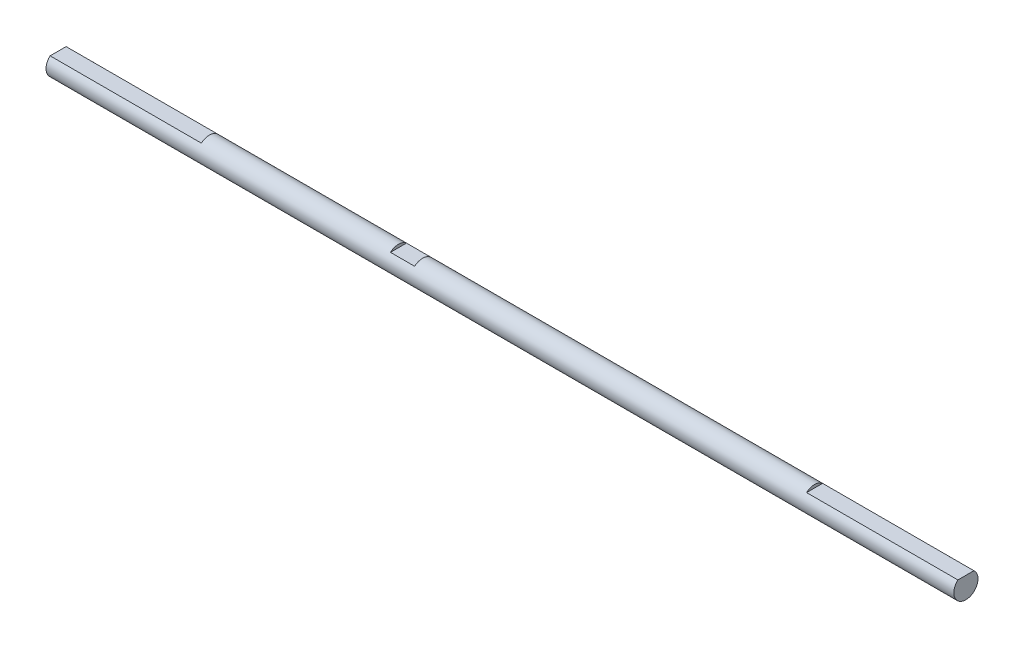
ISO-10303-21;
HEADER;
FILE_DESCRIPTION(('STEP AP214'),'2;1');
FILE_NAME('part.step','',(''),(''),'','','');
FILE_SCHEMA(('AUTOMOTIVE_DESIGN { 1 0 10303 214 1 1 1 1 }'));
ENDSEC;
DATA;
#1=APPLICATION_CONTEXT('core data for automotive mechanical design processes');
#2=APPLICATION_PROTOCOL_DEFINITION('international standard','automotive_design',2000,#1);
#3=PRODUCT_CONTEXT('',#1,'mechanical');
#4=PRODUCT('Part','Part','',(#3));
#5=PRODUCT_RELATED_PRODUCT_CATEGORY('part','',(#4));
#6=PRODUCT_DEFINITION_FORMATION('','',#4);
#7=PRODUCT_DEFINITION_CONTEXT('part definition',#1,'design');
#8=PRODUCT_DEFINITION('design','',#6,#7);
#9=PRODUCT_DEFINITION_SHAPE('','',#8);
#10=(LENGTH_UNIT() NAMED_UNIT(*) SI_UNIT(.MILLI.,.METRE.));
#11=(NAMED_UNIT(*) PLANE_ANGLE_UNIT() SI_UNIT($,.RADIAN.));
#12=(NAMED_UNIT(*) SI_UNIT($,.STERADIAN.) SOLID_ANGLE_UNIT());
#13=UNCERTAINTY_MEASURE_WITH_UNIT(LENGTH_MEASURE(1.E-05),#10,'distance_accuracy_value','');
#14=(GEOMETRIC_REPRESENTATION_CONTEXT(3) GLOBAL_UNCERTAINTY_ASSIGNED_CONTEXT((#13)) GLOBAL_UNIT_ASSIGNED_CONTEXT((#10,
#11,#12)) REPRESENTATION_CONTEXT('',''));
#15=CARTESIAN_POINT('',(0.,0.,0.));
#16=DIRECTION('',(0.,0.,1.));
#17=DIRECTION('',(1.,0.,0.));
#18=AXIS2_PLACEMENT_3D('',#15,#16,#17);
#19=CARTESIAN_POINT('',(75.,1.5,1.3228756555323));
#20=DIRECTION('',(0.,-1.,0.));
#21=DIRECTION('',(0.,0.,-1.));
#22=AXIS2_PLACEMENT_3D('',#19,#20,#21);
#23=PLANE('',#22);
#24=DIRECTION('',(0.,0.,1.));
#25=VECTOR('',#24,1.);
#26=CARTESIAN_POINT('',(-50.,1.5,1.3228756555323));
#27=LINE('',#26,#25);
#28=CARTESIAN_POINT('',(-50.,1.5,-1.3228756555323));
#29=VERTEX_POINT('',#28);
#30=CARTESIAN_POINT('',(-50.,1.5,1.3228756555323));
#31=VERTEX_POINT('',#30);
#32=EDGE_CURVE('E69',#29,#31,#27,.T.);
#33=ORIENTED_EDGE('',*,*,#32,.F.);
#34=DIRECTION('',(-1.,0.,0.));
#35=VECTOR('',#34,1.);
#36=CARTESIAN_POINT('',(75.,1.5,-1.3228756555323));
#37=LINE('',#36,#35);
#38=CARTESIAN_POINT('',(-75.,1.5,-1.3228756555323));
#39=VERTEX_POINT('',#38);
#40=EDGE_CURVE('E144',#29,#39,#37,.T.);
#41=ORIENTED_EDGE('',*,*,#40,.T.);
#42=DIRECTION('',(0.,0.,1.));
#43=VECTOR('',#42,1.);
#44=CARTESIAN_POINT('',(-75.,1.5,1.3228756555323));
#45=LINE('',#44,#43);
#46=CARTESIAN_POINT('',(-75.,1.5,1.3228756555323));
#47=VERTEX_POINT('',#46);
#48=EDGE_CURVE('E130',#39,#47,#45,.T.);
#49=ORIENTED_EDGE('',*,*,#48,.T.);
#50=DIRECTION('',(-1.,0.,0.));
#51=VECTOR('',#50,1.);
#52=CARTESIAN_POINT('',(75.,1.5,1.3228756555323));
#53=LINE('',#52,#51);
#54=EDGE_CURVE('E133',#31,#47,#53,.T.);
#55=ORIENTED_EDGE('',*,*,#54,.F.);
#56=EDGE_LOOP('',(#33,#41,#49,#55));
#57=FACE_BOUND('',#56,.T.);
#58=ADVANCED_FACE('F45',(#57),#23,.F.);
#59=CARTESIAN_POINT('',(75.,0.,0.));
#60=DIRECTION('',(-1.,0.,0.));
#61=DIRECTION('',(0.,0.,1.));
#62=AXIS2_PLACEMENT_3D('',#59,#60,#61);
#63=CYLINDRICAL_SURFACE('',#62,2.);
#64=CARTESIAN_POINT('',(-14.76,0.,0.));
#65=DIRECTION('',(1.,0.,0.));
#66=DIRECTION('',(0.,0.,-1.));
#67=AXIS2_PLACEMENT_3D('',#64,#65,#66);
#68=CIRCLE('',#67,2.);
#69=CARTESIAN_POINT('',(-14.76,1.5,-1.3228756555323));
#70=VERTEX_POINT('',#69);
#71=CARTESIAN_POINT('',(-14.76,1.5,1.3228756555323));
#72=VERTEX_POINT('',#71);
#73=EDGE_CURVE('E99',#70,#72,#68,.T.);
#74=ORIENTED_EDGE('',*,*,#73,.T.);
#75=DIRECTION('',(-1.,0.,0.));
#76=VECTOR('',#75,1.);
#77=CARTESIAN_POINT('',(75.,1.5,1.3228756555323));
#78=LINE('',#77,#76);
#79=CARTESIAN_POINT('',(-18.76,1.5,1.3228756555323));
#80=VERTEX_POINT('',#79);
#81=EDGE_CURVE('E11',#72,#80,#78,.T.);
#82=ORIENTED_EDGE('',*,*,#81,.T.);
#83=CARTESIAN_POINT('',(-18.76,0.,0.));
#84=DIRECTION('',(-1.,0.,0.));
#85=DIRECTION('',(0.,-1.,0.));
#86=AXIS2_PLACEMENT_3D('',#83,#84,#85);
#87=CIRCLE('',#86,2.);
#88=CARTESIAN_POINT('',(-18.76,1.5,-1.3228756555323));
#89=VERTEX_POINT('',#88);
#90=EDGE_CURVE('E54',#80,#89,#87,.T.);
#91=ORIENTED_EDGE('',*,*,#90,.T.);
#92=DIRECTION('',(-1.,0.,0.));
#93=VECTOR('',#92,1.);
#94=CARTESIAN_POINT('',(75.,1.5,-1.3228756555323));
#95=LINE('',#94,#93);
#96=EDGE_CURVE('E102',#89,#70,#95,.F.);
#97=ORIENTED_EDGE('',*,*,#96,.T.);
#98=EDGE_LOOP('',(#74,#82,#91,#97));
#99=FACE_BOUND('',#98,.T.);
#100=CARTESIAN_POINT('',(75.,1.5,1.3228756555323));
#101=VERTEX_POINT('',#100);
#102=CARTESIAN_POINT('',(50.,1.5,1.3228756555323));
#103=VERTEX_POINT('',#102);
#104=EDGE_CURVE('E140',#101,#103,#53,.T.);
#105=ORIENTED_EDGE('',*,*,#104,.T.);
#106=CARTESIAN_POINT('',(50.,0.,0.));
#107=DIRECTION('',(1.,0.,0.));
#108=DIRECTION('',(0.,0.,-1.));
#109=AXIS2_PLACEMENT_3D('',#106,#107,#108);
#110=CIRCLE('',#109,2.);
#111=CARTESIAN_POINT('',(50.,1.5,-1.3228756555323));
#112=VERTEX_POINT('',#111);
#113=EDGE_CURVE('E117',#112,#103,#110,.T.);
#114=ORIENTED_EDGE('',*,*,#113,.F.);
#115=CARTESIAN_POINT('',(75.,1.5,-1.3228756555323));
#116=VERTEX_POINT('',#115);
#117=EDGE_CURVE('E145',#116,#112,#37,.T.);
#118=ORIENTED_EDGE('',*,*,#117,.F.);
#119=CARTESIAN_POINT('',(75.,0.,0.));
#120=DIRECTION('',(1.,0.,0.));
#121=DIRECTION('',(0.,0.,-1.));
#122=AXIS2_PLACEMENT_3D('',#119,#120,#121);
#123=CIRCLE('',#122,2.);
#124=EDGE_CURVE('E125',#101,#116,#123,.T.);
#125=ORIENTED_EDGE('',*,*,#124,.F.);
#126=EDGE_LOOP('',(#105,#114,#118,#125));
#127=FACE_BOUND('',#126,.T.);
#128=ORIENTED_EDGE('',*,*,#40,.F.);
#129=CARTESIAN_POINT('',(-50.,0.,0.));
#130=DIRECTION('',(1.,0.,0.));
#131=DIRECTION('',(0.,0.,-1.));
#132=AXIS2_PLACEMENT_3D('',#129,#130,#131);
#133=CIRCLE('',#132,2.);
#134=EDGE_CURVE('E112',#29,#31,#133,.T.);
#135=ORIENTED_EDGE('',*,*,#134,.T.);
#136=ORIENTED_EDGE('',*,*,#54,.T.);
#137=CARTESIAN_POINT('',(-75.,0.,0.));
#138=DIRECTION('',(1.,0.,0.));
#139=DIRECTION('',(0.,0.,-1.));
#140=AXIS2_PLACEMENT_3D('',#137,#138,#139);
#141=CIRCLE('',#140,2.);
#142=EDGE_CURVE('E123',#47,#39,#141,.T.);
#143=ORIENTED_EDGE('',*,*,#142,.T.);
#144=EDGE_LOOP('',(#128,#135,#136,#143));
#145=FACE_BOUND('',#144,.T.);
#146=ADVANCED_FACE('F47',(#99,#127,#145),#63,.T.);
#147=ORIENTED_EDGE('',*,*,#117,.T.);
#148=DIRECTION('',(0.,0.,1.));
#149=VECTOR('',#148,1.);
#150=CARTESIAN_POINT('',(50.,1.5,1.3228756555323));
#151=LINE('',#150,#149);
#152=EDGE_CURVE('E150',#112,#103,#151,.T.);
#153=ORIENTED_EDGE('',*,*,#152,.T.);
#154=ORIENTED_EDGE('',*,*,#104,.F.);
#155=DIRECTION('',(0.,0.,1.));
#156=VECTOR('',#155,1.);
#157=CARTESIAN_POINT('',(75.,1.5,1.3228756555323));
#158=LINE('',#157,#156);
#159=EDGE_CURVE('E129',#116,#101,#158,.T.);
#160=ORIENTED_EDGE('',*,*,#159,.F.);
#161=EDGE_LOOP('',(#147,#153,#154,#160));
#162=FACE_BOUND('',#161,.T.);
#163=ADVANCED_FACE('F172',(#162),#23,.F.);
#164=CARTESIAN_POINT('',(75.,0.,0.));
#165=DIRECTION('',(1.,0.,0.));
#166=DIRECTION('',(0.,0.,-1.));
#167=AXIS2_PLACEMENT_3D('',#164,#165,#166);
#168=PLANE('',#167);
#169=ORIENTED_EDGE('',*,*,#124,.T.);
#170=ORIENTED_EDGE('',*,*,#159,.T.);
#171=EDGE_LOOP('',(#169,#170));
#172=FACE_BOUND('',#171,.T.);
#173=ADVANCED_FACE('F178',(#172),#168,.T.);
#174=CARTESIAN_POINT('',(-75.,0.,0.));
#175=DIRECTION('',(1.,0.,0.));
#176=DIRECTION('',(0.,0.,-1.));
#177=AXIS2_PLACEMENT_3D('',#174,#175,#176);
#178=PLANE('',#177);
#179=ORIENTED_EDGE('',*,*,#142,.F.);
#180=ORIENTED_EDGE('',*,*,#48,.F.);
#181=EDGE_LOOP('',(#179,#180));
#182=FACE_BOUND('',#181,.T.);
#183=ADVANCED_FACE('F184',(#182),#178,.F.);
#184=CARTESIAN_POINT('',(50.,0.,0.));
#185=DIRECTION('',(1.,0.,0.));
#186=DIRECTION('',(0.,0.,-1.));
#187=AXIS2_PLACEMENT_3D('',#184,#185,#186);
#188=PLANE('',#187);
#189=ORIENTED_EDGE('',*,*,#152,.F.);
#190=ORIENTED_EDGE('',*,*,#113,.T.);
#191=EDGE_LOOP('',(#189,#190));
#192=FACE_BOUND('',#191,.T.);
#193=ADVANCED_FACE('F166',(#192),#188,.T.);
#194=CARTESIAN_POINT('',(-50.,0.,0.));
#195=DIRECTION('',(1.,0.,0.));
#196=DIRECTION('',(0.,0.,-1.));
#197=AXIS2_PLACEMENT_3D('',#194,#195,#196);
#198=PLANE('',#197);
#199=ORIENTED_EDGE('',*,*,#134,.F.);
#200=ORIENTED_EDGE('',*,*,#32,.T.);
#201=EDGE_LOOP('',(#199,#200));
#202=FACE_BOUND('',#201,.T.);
#203=ADVANCED_FACE('F158',(#202),#198,.F.);
#204=CARTESIAN_POINT('',(-18.76,2.,-2.));
#205=DIRECTION('',(-1.,0.,0.));
#206=DIRECTION('',(0.,-1.,0.));
#207=AXIS2_PLACEMENT_3D('',#204,#205,#206);
#208=PLANE('',#207);
#209=DIRECTION('',(0.,0.,1.));
#210=VECTOR('',#209,1.);
#211=CARTESIAN_POINT('',(-18.76,1.5,-2.));
#212=LINE('',#211,#210);
#213=EDGE_CURVE('E109',#89,#80,#212,.T.);
#214=ORIENTED_EDGE('',*,*,#213,.F.);
#215=ORIENTED_EDGE('',*,*,#90,.F.);
#216=EDGE_LOOP('',(#214,#215));
#217=FACE_BOUND('',#216,.T.);
#218=ADVANCED_FACE('F156',(#217),#208,.F.);
#219=CARTESIAN_POINT('',(-14.76,2.,-2.));
#220=DIRECTION('',(1.,0.,0.));
#221=DIRECTION('',(0.,0.,-1.));
#222=AXIS2_PLACEMENT_3D('',#219,#220,#221);
#223=PLANE('',#222);
#224=DIRECTION('',(0.,0.,1.));
#225=VECTOR('',#224,1.);
#226=CARTESIAN_POINT('',(-14.76,1.5,-2.));
#227=LINE('',#226,#225);
#228=EDGE_CURVE('E61',#70,#72,#227,.T.);
#229=ORIENTED_EDGE('',*,*,#228,.T.);
#230=ORIENTED_EDGE('',*,*,#73,.F.);
#231=EDGE_LOOP('',(#229,#230));
#232=FACE_BOUND('',#231,.T.);
#233=ADVANCED_FACE('F110',(#232),#223,.F.);
#234=CARTESIAN_POINT('',(-18.76,1.5,-2.));
#235=DIRECTION('',(0.,-1.,0.));
#236=DIRECTION('',(0.,0.,-1.));
#237=AXIS2_PLACEMENT_3D('',#234,#235,#236);
#238=PLANE('',#237);
#239=ORIENTED_EDGE('',*,*,#228,.F.);
#240=ORIENTED_EDGE('',*,*,#96,.F.);
#241=ORIENTED_EDGE('',*,*,#213,.T.);
#242=ORIENTED_EDGE('',*,*,#81,.F.);
#243=EDGE_LOOP('',(#239,#240,#241,#242));
#244=FACE_BOUND('',#243,.T.);
#245=ADVANCED_FACE('F107',(#244),#238,.F.);
#246=CLOSED_SHELL('',(#58,#146,#163,#173,#183,#193,#203,#218,#233,#245));
#247=MANIFOLD_SOLID_BREP('B2',#246);
#248=ADVANCED_BREP_SHAPE_REPRESENTATION('',(#18,#247),#14);
#249=SHAPE_DEFINITION_REPRESENTATION(#9,#248);
ENDSEC;
END-ISO-10303-21;
